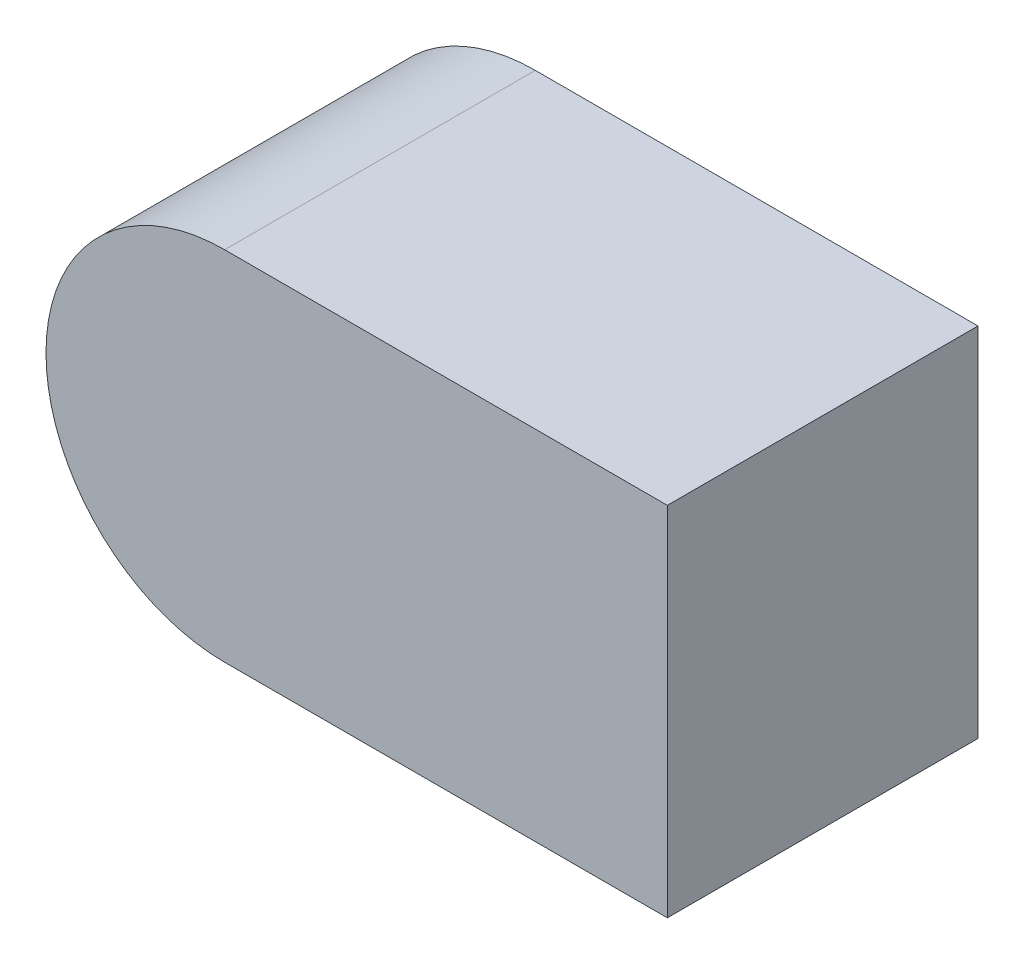
ISO-10303-21;
HEADER;
FILE_DESCRIPTION(('STEP AP214'),'2;1');
FILE_NAME('part.step','',(''),(''),'','','');
FILE_SCHEMA(('AUTOMOTIVE_DESIGN { 1 0 10303 214 1 1 1 1 }'));
ENDSEC;
DATA;
#1=APPLICATION_CONTEXT('core data for automotive mechanical design processes');
#2=APPLICATION_PROTOCOL_DEFINITION('international standard','automotive_design',2000,#1);
#3=PRODUCT_CONTEXT('',#1,'mechanical');
#4=PRODUCT('Part','Part','',(#3));
#5=PRODUCT_RELATED_PRODUCT_CATEGORY('part','',(#4));
#6=PRODUCT_DEFINITION_FORMATION('','',#4);
#7=PRODUCT_DEFINITION_CONTEXT('part definition',#1,'design');
#8=PRODUCT_DEFINITION('design','',#6,#7);
#9=PRODUCT_DEFINITION_SHAPE('','',#8);
#10=(LENGTH_UNIT() NAMED_UNIT(*) SI_UNIT(.MILLI.,.METRE.));
#11=(NAMED_UNIT(*) PLANE_ANGLE_UNIT() SI_UNIT($,.RADIAN.));
#12=(NAMED_UNIT(*) SI_UNIT($,.STERADIAN.) SOLID_ANGLE_UNIT());
#13=UNCERTAINTY_MEASURE_WITH_UNIT(LENGTH_MEASURE(1.E-05),#10,'distance_accuracy_value','');
#14=(GEOMETRIC_REPRESENTATION_CONTEXT(3) GLOBAL_UNCERTAINTY_ASSIGNED_CONTEXT((#13)) GLOBAL_UNIT_ASSIGNED_CONTEXT((#10,
#11,#12)) REPRESENTATION_CONTEXT('',''));
#15=CARTESIAN_POINT('',(0.,0.,0.));
#16=DIRECTION('',(0.,0.,1.));
#17=DIRECTION('',(1.,0.,0.));
#18=AXIS2_PLACEMENT_3D('',#15,#16,#17);
#19=CARTESIAN_POINT('',(2.8335265642716,-0.750000000000001,0.));
#20=DIRECTION('',(0.,0.,1.));
#21=DIRECTION('',(-1.,0.,0.));
#22=AXIS2_PLACEMENT_3D('',#19,#20,#21);
#23=PLANE('',#22);
#24=DIRECTION('',(0.,1.,0.));
#25=VECTOR('',#24,1.);
#26=CARTESIAN_POINT('',(3.,-0.865,0.));
#27=LINE('',#26,#25);
#28=CARTESIAN_POINT('',(3.,-0.865,0.));
#29=VERTEX_POINT('',#28);
#30=CARTESIAN_POINT('',(3.,-0.635,0.));
#31=VERTEX_POINT('',#30);
#32=EDGE_CURVE('E11',#29,#31,#27,.T.);
#33=ORIENTED_EDGE('',*,*,#32,.F.);
#34=DIRECTION('',(1.,0.,0.));
#35=VECTOR('',#34,1.);
#36=CARTESIAN_POINT('',(2.715,-0.865,0.));
#37=LINE('',#36,#35);
#38=CARTESIAN_POINT('',(2.715,-0.865,0.));
#39=VERTEX_POINT('',#38);
#40=EDGE_CURVE('E24',#39,#29,#37,.T.);
#41=ORIENTED_EDGE('',*,*,#40,.F.);
#42=CARTESIAN_POINT('',(2.715,-0.75,0.));
#43=DIRECTION('',(0.,0.,1.));
#44=DIRECTION('',(0.,1.,0.));
#45=AXIS2_PLACEMENT_3D('',#42,#43,#44);
#46=CIRCLE('',#45,0.115);
#47=CARTESIAN_POINT('',(2.715,-0.635000000000001,0.));
#48=VERTEX_POINT('',#47);
#49=EDGE_CURVE('E85',#48,#39,#46,.T.);
#50=ORIENTED_EDGE('',*,*,#49,.F.);
#51=DIRECTION('',(-1.,0.,0.));
#52=VECTOR('',#51,1.);
#53=CARTESIAN_POINT('',(3.,-0.635,0.));
#54=LINE('',#53,#52);
#55=EDGE_CURVE('E82',#31,#48,#54,.T.);
#56=ORIENTED_EDGE('',*,*,#55,.F.);
#57=EDGE_LOOP('',(#33,#41,#50,#56));
#58=FACE_BOUND('',#57,.T.);
#59=ADVANCED_FACE('F17',(#58),#23,.F.);
#60=CARTESIAN_POINT('',(3.,-0.635,0.));
#61=DIRECTION('',(0.,1.,0.));
#62=DIRECTION('',(-1.,0.,0.));
#63=AXIS2_PLACEMENT_3D('',#60,#61,#62);
#64=PLANE('',#63);
#65=ORIENTED_EDGE('',*,*,#55,.T.);
#66=DIRECTION('',(0.,0.,1.));
#67=VECTOR('',#66,1.);
#68=CARTESIAN_POINT('',(2.715,-0.635000000000001,0.));
#69=LINE('',#68,#67);
#70=CARTESIAN_POINT('',(2.715,-0.635000000000001,0.2));
#71=VERTEX_POINT('',#70);
#72=EDGE_CURVE('E80',#48,#71,#69,.T.);
#73=ORIENTED_EDGE('',*,*,#72,.T.);
#74=DIRECTION('',(-1.,0.,0.));
#75=VECTOR('',#74,1.);
#76=CARTESIAN_POINT('',(3.,-0.635,0.2));
#77=LINE('',#76,#75);
#78=CARTESIAN_POINT('',(3.,-0.635,0.2));
#79=VERTEX_POINT('',#78);
#80=EDGE_CURVE('E78',#79,#71,#77,.T.);
#81=ORIENTED_EDGE('',*,*,#80,.F.);
#82=DIRECTION('',(0.,0.,-1.));
#83=VECTOR('',#82,1.);
#84=CARTESIAN_POINT('',(3.,-0.635,0.));
#85=LINE('',#84,#83);
#86=EDGE_CURVE('E71',#79,#31,#85,.T.);
#87=ORIENTED_EDGE('',*,*,#86,.T.);
#88=EDGE_LOOP('',(#65,#73,#81,#87));
#89=FACE_BOUND('',#88,.T.);
#90=ADVANCED_FACE('F91',(#89),#64,.T.);
#91=CARTESIAN_POINT('',(2.715,-0.75,0.));
#92=DIRECTION('',(0.,0.,1.));
#93=DIRECTION('',(0.,1.,0.));
#94=AXIS2_PLACEMENT_3D('',#91,#92,#93);
#95=CYLINDRICAL_SURFACE('',#94,0.115);
#96=ORIENTED_EDGE('',*,*,#49,.T.);
#97=DIRECTION('',(0.,0.,1.));
#98=VECTOR('',#97,1.);
#99=CARTESIAN_POINT('',(2.715,-0.865,0.));
#100=LINE('',#99,#98);
#101=CARTESIAN_POINT('',(2.715,-0.865,0.2));
#102=VERTEX_POINT('',#101);
#103=EDGE_CURVE('E75',#39,#102,#100,.T.);
#104=ORIENTED_EDGE('',*,*,#103,.T.);
#105=CARTESIAN_POINT('',(2.715,-0.75,0.2));
#106=DIRECTION('',(0.,0.,1.));
#107=DIRECTION('',(0.,1.,0.));
#108=AXIS2_PLACEMENT_3D('',#105,#106,#107);
#109=CIRCLE('',#108,0.115);
#110=EDGE_CURVE('E59',#71,#102,#109,.T.);
#111=ORIENTED_EDGE('',*,*,#110,.F.);
#112=ORIENTED_EDGE('',*,*,#72,.F.);
#113=EDGE_LOOP('',(#96,#104,#111,#112));
#114=FACE_BOUND('',#113,.T.);
#115=ADVANCED_FACE('F89',(#114),#95,.T.);
#116=CARTESIAN_POINT('',(2.715,-0.865,0.));
#117=DIRECTION('',(0.,-1.,0.));
#118=DIRECTION('',(1.,0.,0.));
#119=AXIS2_PLACEMENT_3D('',#116,#117,#118);
#120=PLANE('',#119);
#121=ORIENTED_EDGE('',*,*,#40,.T.);
#122=DIRECTION('',(0.,0.,1.));
#123=VECTOR('',#122,1.);
#124=CARTESIAN_POINT('',(3.,-0.865,0.));
#125=LINE('',#124,#123);
#126=CARTESIAN_POINT('',(3.,-0.865,0.2));
#127=VERTEX_POINT('',#126);
#128=EDGE_CURVE('E53',#29,#127,#125,.T.);
#129=ORIENTED_EDGE('',*,*,#128,.T.);
#130=DIRECTION('',(1.,0.,0.));
#131=VECTOR('',#130,1.);
#132=CARTESIAN_POINT('',(2.715,-0.865,0.2));
#133=LINE('',#132,#131);
#134=EDGE_CURVE('E57',#102,#127,#133,.T.);
#135=ORIENTED_EDGE('',*,*,#134,.F.);
#136=ORIENTED_EDGE('',*,*,#103,.F.);
#137=EDGE_LOOP('',(#121,#129,#135,#136));
#138=FACE_BOUND('',#137,.T.);
#139=ADVANCED_FACE('F55',(#138),#120,.T.);
#140=CARTESIAN_POINT('',(3.,-3.,0.));
#141=DIRECTION('',(1.,0.,0.));
#142=DIRECTION('',(0.,1.,0.));
#143=AXIS2_PLACEMENT_3D('',#140,#141,#142);
#144=PLANE('',#143);
#145=ORIENTED_EDGE('',*,*,#86,.F.);
#146=DIRECTION('',(0.,1.,0.));
#147=VECTOR('',#146,1.);
#148=CARTESIAN_POINT('',(3.,-1.875,0.2));
#149=LINE('',#148,#147);
#150=EDGE_CURVE('E66',#127,#79,#149,.T.);
#151=ORIENTED_EDGE('',*,*,#150,.F.);
#152=ORIENTED_EDGE('',*,*,#128,.F.);
#153=ORIENTED_EDGE('',*,*,#32,.T.);
#154=EDGE_LOOP('',(#145,#151,#152,#153));
#155=FACE_BOUND('',#154,.T.);
#156=ADVANCED_FACE('F69',(#155),#144,.T.);
#157=CARTESIAN_POINT('',(2.8335240809167,-0.75,0.2));
#158=DIRECTION('',(0.,0.,1.));
#159=DIRECTION('',(1.,0.,0.));
#160=AXIS2_PLACEMENT_3D('',#157,#158,#159);
#161=PLANE('',#160);
#162=ORIENTED_EDGE('',*,*,#134,.T.);
#163=ORIENTED_EDGE('',*,*,#150,.T.);
#164=ORIENTED_EDGE('',*,*,#80,.T.);
#165=ORIENTED_EDGE('',*,*,#110,.T.);
#166=EDGE_LOOP('',(#162,#163,#164,#165));
#167=FACE_BOUND('',#166,.T.);
#168=ADVANCED_FACE('F64',(#167),#161,.T.);
#169=CLOSED_SHELL('',(#59,#90,#115,#139,#156,#168));
#170=MANIFOLD_SOLID_BREP('B1',#169);
#171=ADVANCED_BREP_SHAPE_REPRESENTATION('',(#18,#170),#14);
#172=SHAPE_DEFINITION_REPRESENTATION(#9,#171);
ENDSEC;
END-ISO-10303-21;
